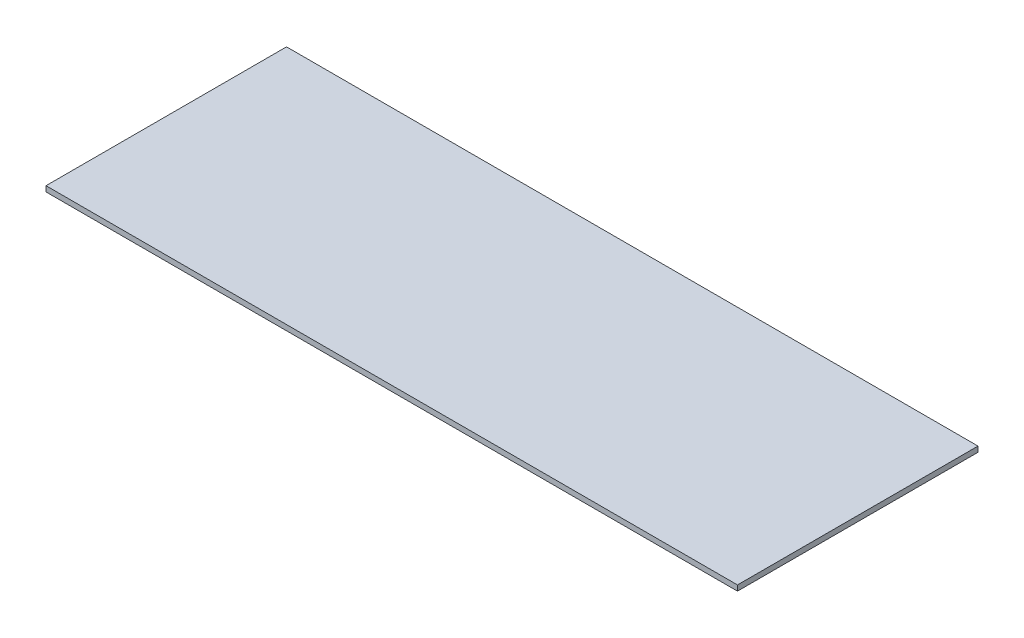
ISO-10303-21;
HEADER;
FILE_DESCRIPTION(('STEP AP214'),'2;1');
FILE_NAME('part.step','',(''),(''),'','','');
FILE_SCHEMA(('AUTOMOTIVE_DESIGN { 1 0 10303 214 1 1 1 1 }'));
ENDSEC;
DATA;
#1=APPLICATION_CONTEXT('core data for automotive mechanical design processes');
#2=APPLICATION_PROTOCOL_DEFINITION('international standard','automotive_design',2000,#1);
#3=PRODUCT_CONTEXT('',#1,'mechanical');
#4=PRODUCT('Part','Part','',(#3));
#5=PRODUCT_RELATED_PRODUCT_CATEGORY('part','',(#4));
#6=PRODUCT_DEFINITION_FORMATION('','',#4);
#7=PRODUCT_DEFINITION_CONTEXT('part definition',#1,'design');
#8=PRODUCT_DEFINITION('design','',#6,#7);
#9=PRODUCT_DEFINITION_SHAPE('','',#8);
#10=(LENGTH_UNIT() NAMED_UNIT(*) SI_UNIT(.MILLI.,.METRE.));
#11=(NAMED_UNIT(*) PLANE_ANGLE_UNIT() SI_UNIT($,.RADIAN.));
#12=(NAMED_UNIT(*) SI_UNIT($,.STERADIAN.) SOLID_ANGLE_UNIT());
#13=UNCERTAINTY_MEASURE_WITH_UNIT(LENGTH_MEASURE(1.E-05),#10,'distance_accuracy_value','');
#14=(GEOMETRIC_REPRESENTATION_CONTEXT(3) GLOBAL_UNCERTAINTY_ASSIGNED_CONTEXT((#13)) GLOBAL_UNIT_ASSIGNED_CONTEXT((#10,
#11,#12)) REPRESENTATION_CONTEXT('',''));
#15=CARTESIAN_POINT('',(0.,0.,0.));
#16=DIRECTION('',(0.,0.,1.));
#17=DIRECTION('',(1.,0.,0.));
#18=AXIS2_PLACEMENT_3D('',#15,#16,#17);
#19=CARTESIAN_POINT('',(0.,18.,0.));
#20=DIRECTION('',(1.,0.,0.));
#21=DIRECTION('',(0.,0.,-1.));
#22=AXIS2_PLACEMENT_3D('',#19,#20,#21);
#23=PLANE('',#22);
#24=DIRECTION('',(0.,0.,1.));
#25=VECTOR('',#24,1.);
#26=CARTESIAN_POINT('',(0.,0.,0.));
#27=LINE('',#26,#25);
#28=CARTESIAN_POINT('',(0.,0.,-800.));
#29=VERTEX_POINT('',#28);
#30=CARTESIAN_POINT('',(0.,0.,0.));
#31=VERTEX_POINT('',#30);
#32=EDGE_CURVE('E96',#29,#31,#27,.T.);
#33=ORIENTED_EDGE('',*,*,#32,.T.);
#34=DIRECTION('',(0.,-1.,0.));
#35=VECTOR('',#34,1.);
#36=CARTESIAN_POINT('',(0.,18.,0.));
#37=LINE('',#36,#35);
#38=CARTESIAN_POINT('',(0.,18.,0.));
#39=VERTEX_POINT('',#38);
#40=EDGE_CURVE('E11',#39,#31,#37,.T.);
#41=ORIENTED_EDGE('',*,*,#40,.F.);
#42=DIRECTION('',(0.,0.,1.));
#43=VECTOR('',#42,1.);
#44=CARTESIAN_POINT('',(0.,18.,0.));
#45=LINE('',#44,#43);
#46=CARTESIAN_POINT('',(0.,18.,-800.));
#47=VERTEX_POINT('',#46);
#48=EDGE_CURVE('E84',#47,#39,#45,.T.);
#49=ORIENTED_EDGE('',*,*,#48,.F.);
#50=DIRECTION('',(0.,-1.,0.));
#51=VECTOR('',#50,1.);
#52=CARTESIAN_POINT('',(0.,18.,-800.));
#53=LINE('',#52,#51);
#54=EDGE_CURVE('E92',#47,#29,#53,.T.);
#55=ORIENTED_EDGE('',*,*,#54,.T.);
#56=EDGE_LOOP('',(#33,#41,#49,#55));
#57=FACE_BOUND('',#56,.T.);
#58=ADVANCED_FACE('F33',(#57),#23,.F.);
#59=CARTESIAN_POINT('',(0.,18.,0.));
#60=DIRECTION('',(0.,0.,-1.));
#61=DIRECTION('',(-1.,0.,0.));
#62=AXIS2_PLACEMENT_3D('',#59,#60,#61);
#63=PLANE('',#62);
#64=DIRECTION('',(1.,0.,0.));
#65=VECTOR('',#64,1.);
#66=CARTESIAN_POINT('',(0.,0.,0.));
#67=LINE('',#66,#65);
#68=CARTESIAN_POINT('',(2300.,0.,0.));
#69=VERTEX_POINT('',#68);
#70=EDGE_CURVE('E88',#31,#69,#67,.T.);
#71=ORIENTED_EDGE('',*,*,#70,.T.);
#72=DIRECTION('',(0.,-1.,0.));
#73=VECTOR('',#72,1.);
#74=CARTESIAN_POINT('',(2300.,18.,0.));
#75=LINE('',#74,#73);
#76=CARTESIAN_POINT('',(2300.,18.,0.));
#77=VERTEX_POINT('',#76);
#78=EDGE_CURVE('E41',#77,#69,#75,.T.);
#79=ORIENTED_EDGE('',*,*,#78,.F.);
#80=DIRECTION('',(1.,0.,0.));
#81=VECTOR('',#80,1.);
#82=CARTESIAN_POINT('',(0.,18.,0.));
#83=LINE('',#82,#81);
#84=EDGE_CURVE('E79',#39,#77,#83,.T.);
#85=ORIENTED_EDGE('',*,*,#84,.F.);
#86=ORIENTED_EDGE('',*,*,#40,.T.);
#87=EDGE_LOOP('',(#71,#79,#85,#86));
#88=FACE_BOUND('',#87,.T.);
#89=ADVANCED_FACE('F87',(#88),#63,.F.);
#90=CARTESIAN_POINT('',(2300.,18.,0.));
#91=DIRECTION('',(-1.,0.,0.));
#92=DIRECTION('',(0.,0.,1.));
#93=AXIS2_PLACEMENT_3D('',#90,#91,#92);
#94=PLANE('',#93);
#95=DIRECTION('',(0.,0.,-1.));
#96=VECTOR('',#95,1.);
#97=CARTESIAN_POINT('',(2300.,0.,0.));
#98=LINE('',#97,#96);
#99=CARTESIAN_POINT('',(2300.,0.,-800.));
#100=VERTEX_POINT('',#99);
#101=EDGE_CURVE('E66',#69,#100,#98,.T.);
#102=ORIENTED_EDGE('',*,*,#101,.T.);
#103=DIRECTION('',(0.,-1.,0.));
#104=VECTOR('',#103,1.);
#105=CARTESIAN_POINT('',(2300.,18.,-800.));
#106=LINE('',#105,#104);
#107=CARTESIAN_POINT('',(2300.,18.,-800.));
#108=VERTEX_POINT('',#107);
#109=EDGE_CURVE('E89',#108,#100,#106,.T.);
#110=ORIENTED_EDGE('',*,*,#109,.F.);
#111=DIRECTION('',(0.,0.,-1.));
#112=VECTOR('',#111,1.);
#113=CARTESIAN_POINT('',(2300.,18.,0.));
#114=LINE('',#113,#112);
#115=EDGE_CURVE('E82',#77,#108,#114,.T.);
#116=ORIENTED_EDGE('',*,*,#115,.F.);
#117=ORIENTED_EDGE('',*,*,#78,.T.);
#118=EDGE_LOOP('',(#102,#110,#116,#117));
#119=FACE_BOUND('',#118,.T.);
#120=ADVANCED_FACE('F90',(#119),#94,.F.);
#121=CARTESIAN_POINT('',(0.,18.,-800.));
#122=DIRECTION('',(0.,0.,1.));
#123=DIRECTION('',(1.,0.,0.));
#124=AXIS2_PLACEMENT_3D('',#121,#122,#123);
#125=PLANE('',#124);
#126=DIRECTION('',(-1.,0.,0.));
#127=VECTOR('',#126,1.);
#128=CARTESIAN_POINT('',(0.,0.,-800.));
#129=LINE('',#128,#127);
#130=EDGE_CURVE('E72',#100,#29,#129,.T.);
#131=ORIENTED_EDGE('',*,*,#130,.T.);
#132=ORIENTED_EDGE('',*,*,#54,.F.);
#133=DIRECTION('',(-1.,0.,0.));
#134=VECTOR('',#133,1.);
#135=CARTESIAN_POINT('',(0.,18.,-800.));
#136=LINE('',#135,#134);
#137=EDGE_CURVE('E49',#108,#47,#136,.T.);
#138=ORIENTED_EDGE('',*,*,#137,.F.);
#139=ORIENTED_EDGE('',*,*,#109,.T.);
#140=EDGE_LOOP('',(#131,#132,#138,#139));
#141=FACE_BOUND('',#140,.T.);
#142=ADVANCED_FACE('F103',(#141),#125,.F.);
#143=CARTESIAN_POINT('',(0.,18.,0.));
#144=DIRECTION('',(0.,-1.,0.));
#145=DIRECTION('',(0.,0.,-1.));
#146=AXIS2_PLACEMENT_3D('',#143,#144,#145);
#147=PLANE('',#146);
#148=ORIENTED_EDGE('',*,*,#48,.T.);
#149=ORIENTED_EDGE('',*,*,#84,.T.);
#150=ORIENTED_EDGE('',*,*,#115,.T.);
#151=ORIENTED_EDGE('',*,*,#137,.T.);
#152=EDGE_LOOP('',(#148,#149,#150,#151));
#153=FACE_BOUND('',#152,.T.);
#154=ADVANCED_FACE('F80',(#153),#147,.F.);
#155=CARTESIAN_POINT('',(0.,0.,0.));
#156=DIRECTION('',(0.,-1.,0.));
#157=DIRECTION('',(0.,0.,-1.));
#158=AXIS2_PLACEMENT_3D('',#155,#156,#157);
#159=PLANE('',#158);
#160=ORIENTED_EDGE('',*,*,#32,.F.);
#161=ORIENTED_EDGE('',*,*,#130,.F.);
#162=ORIENTED_EDGE('',*,*,#101,.F.);
#163=ORIENTED_EDGE('',*,*,#70,.F.);
#164=EDGE_LOOP('',(#160,#161,#162,#163));
#165=FACE_BOUND('',#164,.T.);
#166=ADVANCED_FACE('F106',(#165),#159,.T.);
#167=CLOSED_SHELL('',(#58,#89,#120,#142,#154,#166));
#168=MANIFOLD_SOLID_BREP('B2',#167);
#169=ADVANCED_BREP_SHAPE_REPRESENTATION('',(#18,#168),#14);
#170=SHAPE_DEFINITION_REPRESENTATION(#9,#169);
ENDSEC;
END-ISO-10303-21;
